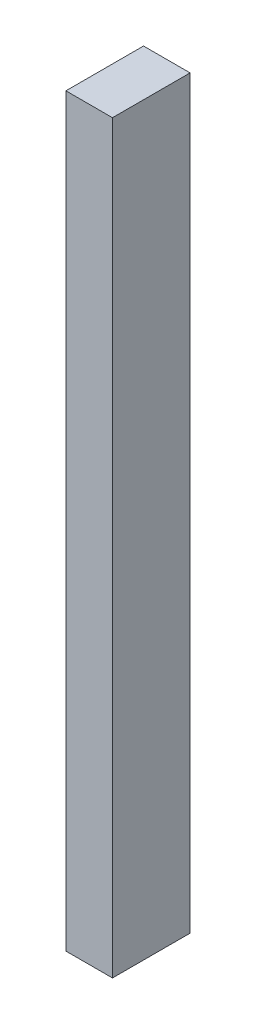
ISO-10303-21;
HEADER;
FILE_DESCRIPTION(('STEP AP214'),'2;1');
FILE_NAME('part.step','',(''),(''),'','','');
FILE_SCHEMA(('AUTOMOTIVE_DESIGN { 1 0 10303 214 1 1 1 1 }'));
ENDSEC;
DATA;
#1=APPLICATION_CONTEXT('core data for automotive mechanical design processes');
#2=APPLICATION_PROTOCOL_DEFINITION('international standard','automotive_design',2000,#1);
#3=PRODUCT_CONTEXT('',#1,'mechanical');
#4=PRODUCT('Part','Part','',(#3));
#5=PRODUCT_RELATED_PRODUCT_CATEGORY('part','',(#4));
#6=PRODUCT_DEFINITION_FORMATION('','',#4);
#7=PRODUCT_DEFINITION_CONTEXT('part definition',#1,'design');
#8=PRODUCT_DEFINITION('design','',#6,#7);
#9=PRODUCT_DEFINITION_SHAPE('','',#8);
#10=(LENGTH_UNIT() NAMED_UNIT(*) SI_UNIT(.MILLI.,.METRE.));
#11=(NAMED_UNIT(*) PLANE_ANGLE_UNIT() SI_UNIT($,.RADIAN.));
#12=(NAMED_UNIT(*) SI_UNIT($,.STERADIAN.) SOLID_ANGLE_UNIT());
#13=UNCERTAINTY_MEASURE_WITH_UNIT(LENGTH_MEASURE(1.E-05),#10,'distance_accuracy_value','');
#14=(GEOMETRIC_REPRESENTATION_CONTEXT(3) GLOBAL_UNCERTAINTY_ASSIGNED_CONTEXT((#13)) GLOBAL_UNIT_ASSIGNED_CONTEXT((#10,
#11,#12)) REPRESENTATION_CONTEXT('',''));
#15=CARTESIAN_POINT('',(0.,0.,0.));
#16=DIRECTION('',(0.,0.,1.));
#17=DIRECTION('',(1.,0.,0.));
#18=AXIS2_PLACEMENT_3D('',#15,#16,#17);
#19=CARTESIAN_POINT('',(19.05,609.6,31.75));
#20=DIRECTION('',(-1.,0.,0.));
#21=DIRECTION('',(0.,0.,1.));
#22=AXIS2_PLACEMENT_3D('',#19,#20,#21);
#23=PLANE('',#22);
#24=DIRECTION('',(0.,0.,-1.));
#25=VECTOR('',#24,1.);
#26=CARTESIAN_POINT('',(19.05,0.,31.75));
#27=LINE('',#26,#25);
#28=CARTESIAN_POINT('',(19.05,0.,31.75));
#29=VERTEX_POINT('',#28);
#30=CARTESIAN_POINT('',(19.05,0.,-31.75));
#31=VERTEX_POINT('',#30);
#32=EDGE_CURVE('E96',#29,#31,#27,.T.);
#33=ORIENTED_EDGE('',*,*,#32,.T.);
#34=DIRECTION('',(0.,-1.,0.));
#35=VECTOR('',#34,1.);
#36=CARTESIAN_POINT('',(19.05,609.6,-31.75));
#37=LINE('',#36,#35);
#38=CARTESIAN_POINT('',(19.05,609.6,-31.75));
#39=VERTEX_POINT('',#38);
#40=EDGE_CURVE('E11',#39,#31,#37,.T.);
#41=ORIENTED_EDGE('',*,*,#40,.F.);
#42=DIRECTION('',(0.,0.,-1.));
#43=VECTOR('',#42,1.);
#44=CARTESIAN_POINT('',(19.05,609.6,31.75));
#45=LINE('',#44,#43);
#46=CARTESIAN_POINT('',(19.05,609.6,31.75));
#47=VERTEX_POINT('',#46);
#48=EDGE_CURVE('E84',#47,#39,#45,.T.);
#49=ORIENTED_EDGE('',*,*,#48,.F.);
#50=DIRECTION('',(0.,-1.,0.));
#51=VECTOR('',#50,1.);
#52=CARTESIAN_POINT('',(19.05,609.6,31.75));
#53=LINE('',#52,#51);
#54=EDGE_CURVE('E92',#47,#29,#53,.T.);
#55=ORIENTED_EDGE('',*,*,#54,.T.);
#56=EDGE_LOOP('',(#33,#41,#49,#55));
#57=FACE_BOUND('',#56,.T.);
#58=ADVANCED_FACE('F33',(#57),#23,.F.);
#59=CARTESIAN_POINT('',(-19.05,609.6,-31.75));
#60=DIRECTION('',(0.,0.,1.));
#61=DIRECTION('',(1.,0.,0.));
#62=AXIS2_PLACEMENT_3D('',#59,#60,#61);
#63=PLANE('',#62);
#64=DIRECTION('',(-1.,0.,0.));
#65=VECTOR('',#64,1.);
#66=CARTESIAN_POINT('',(-19.05,0.,-31.75));
#67=LINE('',#66,#65);
#68=CARTESIAN_POINT('',(-19.05,0.,-31.75));
#69=VERTEX_POINT('',#68);
#70=EDGE_CURVE('E88',#31,#69,#67,.T.);
#71=ORIENTED_EDGE('',*,*,#70,.T.);
#72=DIRECTION('',(0.,-1.,0.));
#73=VECTOR('',#72,1.);
#74=CARTESIAN_POINT('',(-19.05,609.6,-31.75));
#75=LINE('',#74,#73);
#76=CARTESIAN_POINT('',(-19.05,609.6,-31.75));
#77=VERTEX_POINT('',#76);
#78=EDGE_CURVE('E41',#77,#69,#75,.T.);
#79=ORIENTED_EDGE('',*,*,#78,.F.);
#80=DIRECTION('',(-1.,0.,0.));
#81=VECTOR('',#80,1.);
#82=CARTESIAN_POINT('',(-19.05,609.6,-31.75));
#83=LINE('',#82,#81);
#84=EDGE_CURVE('E79',#39,#77,#83,.T.);
#85=ORIENTED_EDGE('',*,*,#84,.F.);
#86=ORIENTED_EDGE('',*,*,#40,.T.);
#87=EDGE_LOOP('',(#71,#79,#85,#86));
#88=FACE_BOUND('',#87,.T.);
#89=ADVANCED_FACE('F87',(#88),#63,.F.);
#90=CARTESIAN_POINT('',(-19.05,609.6,31.75));
#91=DIRECTION('',(1.,0.,0.));
#92=DIRECTION('',(0.,0.,-1.));
#93=AXIS2_PLACEMENT_3D('',#90,#91,#92);
#94=PLANE('',#93);
#95=DIRECTION('',(0.,0.,1.));
#96=VECTOR('',#95,1.);
#97=CARTESIAN_POINT('',(-19.05,0.,31.75));
#98=LINE('',#97,#96);
#99=CARTESIAN_POINT('',(-19.05,0.,31.75));
#100=VERTEX_POINT('',#99);
#101=EDGE_CURVE('E66',#69,#100,#98,.T.);
#102=ORIENTED_EDGE('',*,*,#101,.T.);
#103=DIRECTION('',(0.,-1.,0.));
#104=VECTOR('',#103,1.);
#105=CARTESIAN_POINT('',(-19.05,609.6,31.75));
#106=LINE('',#105,#104);
#107=CARTESIAN_POINT('',(-19.05,609.6,31.75));
#108=VERTEX_POINT('',#107);
#109=EDGE_CURVE('E89',#108,#100,#106,.T.);
#110=ORIENTED_EDGE('',*,*,#109,.F.);
#111=DIRECTION('',(0.,0.,1.));
#112=VECTOR('',#111,1.);
#113=CARTESIAN_POINT('',(-19.05,609.6,31.75));
#114=LINE('',#113,#112);
#115=EDGE_CURVE('E82',#77,#108,#114,.T.);
#116=ORIENTED_EDGE('',*,*,#115,.F.);
#117=ORIENTED_EDGE('',*,*,#78,.T.);
#118=EDGE_LOOP('',(#102,#110,#116,#117));
#119=FACE_BOUND('',#118,.T.);
#120=ADVANCED_FACE('F90',(#119),#94,.F.);
#121=CARTESIAN_POINT('',(-19.05,609.6,31.75));
#122=DIRECTION('',(0.,0.,-1.));
#123=DIRECTION('',(-1.,0.,0.));
#124=AXIS2_PLACEMENT_3D('',#121,#122,#123);
#125=PLANE('',#124);
#126=DIRECTION('',(1.,0.,0.));
#127=VECTOR('',#126,1.);
#128=CARTESIAN_POINT('',(-19.05,0.,31.75));
#129=LINE('',#128,#127);
#130=EDGE_CURVE('E72',#100,#29,#129,.T.);
#131=ORIENTED_EDGE('',*,*,#130,.T.);
#132=ORIENTED_EDGE('',*,*,#54,.F.);
#133=DIRECTION('',(1.,0.,0.));
#134=VECTOR('',#133,1.);
#135=CARTESIAN_POINT('',(-19.05,609.6,31.75));
#136=LINE('',#135,#134);
#137=EDGE_CURVE('E49',#108,#47,#136,.T.);
#138=ORIENTED_EDGE('',*,*,#137,.F.);
#139=ORIENTED_EDGE('',*,*,#109,.T.);
#140=EDGE_LOOP('',(#131,#132,#138,#139));
#141=FACE_BOUND('',#140,.T.);
#142=ADVANCED_FACE('F103',(#141),#125,.F.);
#143=CARTESIAN_POINT('',(0.,609.6,0.));
#144=DIRECTION('',(0.,-1.,0.));
#145=DIRECTION('',(0.,0.,-1.));
#146=AXIS2_PLACEMENT_3D('',#143,#144,#145);
#147=PLANE('',#146);
#148=ORIENTED_EDGE('',*,*,#48,.T.);
#149=ORIENTED_EDGE('',*,*,#84,.T.);
#150=ORIENTED_EDGE('',*,*,#115,.T.);
#151=ORIENTED_EDGE('',*,*,#137,.T.);
#152=EDGE_LOOP('',(#148,#149,#150,#151));
#153=FACE_BOUND('',#152,.T.);
#154=ADVANCED_FACE('F80',(#153),#147,.F.);
#155=CARTESIAN_POINT('',(0.,0.,0.));
#156=DIRECTION('',(0.,-1.,0.));
#157=DIRECTION('',(0.,0.,-1.));
#158=AXIS2_PLACEMENT_3D('',#155,#156,#157);
#159=PLANE('',#158);
#160=ORIENTED_EDGE('',*,*,#32,.F.);
#161=ORIENTED_EDGE('',*,*,#130,.F.);
#162=ORIENTED_EDGE('',*,*,#101,.F.);
#163=ORIENTED_EDGE('',*,*,#70,.F.);
#164=EDGE_LOOP('',(#160,#161,#162,#163));
#165=FACE_BOUND('',#164,.T.);
#166=ADVANCED_FACE('F106',(#165),#159,.T.);
#167=CLOSED_SHELL('',(#58,#89,#120,#142,#154,#166));
#168=MANIFOLD_SOLID_BREP('B2',#167);
#169=ADVANCED_BREP_SHAPE_REPRESENTATION('',(#18,#168),#14);
#170=SHAPE_DEFINITION_REPRESENTATION(#9,#169);
ENDSEC;
END-ISO-10303-21;
